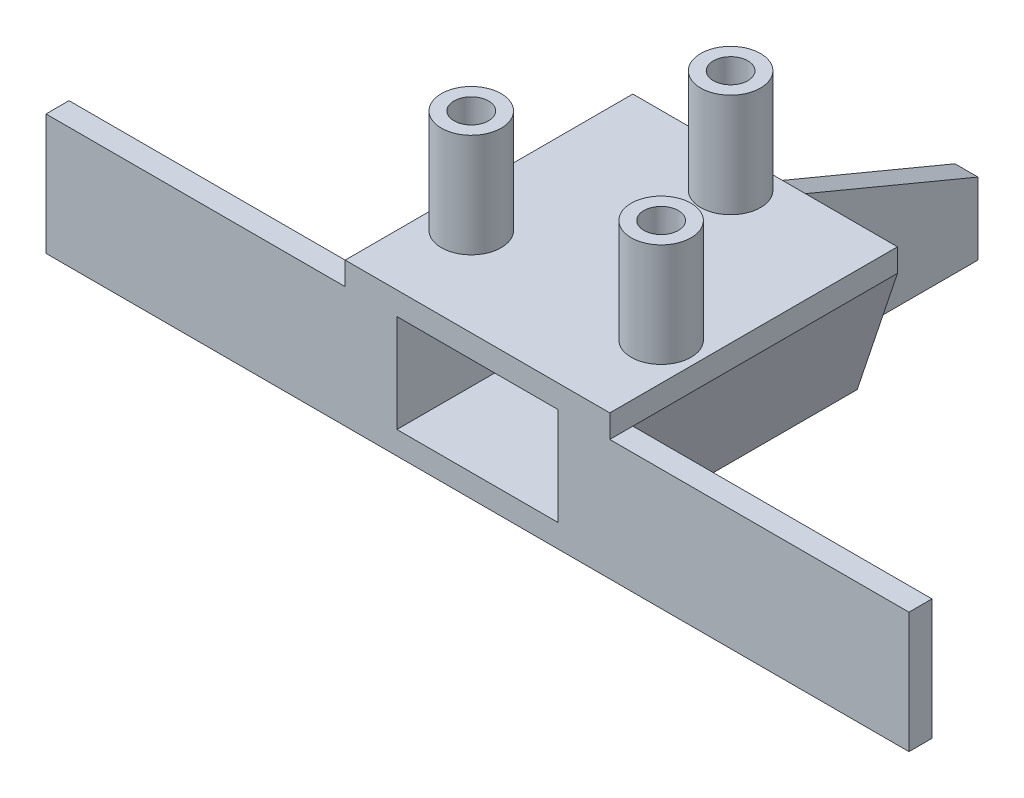
ISO-10303-21;
HEADER;
FILE_DESCRIPTION(('STEP AP214'),'2;1');
FILE_NAME('part.step','',(''),(''),'','','');
FILE_SCHEMA(('AUTOMOTIVE_DESIGN { 1 0 10303 214 1 1 1 1 }'));
ENDSEC;
DATA;
#1=APPLICATION_CONTEXT('core data for automotive mechanical design processes');
#2=APPLICATION_PROTOCOL_DEFINITION('international standard','automotive_design',2000,#1);
#3=PRODUCT_CONTEXT('',#1,'mechanical');
#4=PRODUCT('Part','Part','',(#3));
#5=PRODUCT_RELATED_PRODUCT_CATEGORY('part','',(#4));
#6=PRODUCT_DEFINITION_FORMATION('','',#4);
#7=PRODUCT_DEFINITION_CONTEXT('part definition',#1,'design');
#8=PRODUCT_DEFINITION('design','',#6,#7);
#9=PRODUCT_DEFINITION_SHAPE('','',#8);
#10=(LENGTH_UNIT() NAMED_UNIT(*) SI_UNIT(.MILLI.,.METRE.));
#11=(NAMED_UNIT(*) PLANE_ANGLE_UNIT() SI_UNIT($,.RADIAN.));
#12=(NAMED_UNIT(*) SI_UNIT($,.STERADIAN.) SOLID_ANGLE_UNIT());
#13=UNCERTAINTY_MEASURE_WITH_UNIT(LENGTH_MEASURE(1.E-05),#10,'distance_accuracy_value','');
#14=(GEOMETRIC_REPRESENTATION_CONTEXT(3) GLOBAL_UNCERTAINTY_ASSIGNED_CONTEXT((#13)) GLOBAL_UNIT_ASSIGNED_CONTEXT((#10,
#11,#12)) REPRESENTATION_CONTEXT('',''));
#15=CARTESIAN_POINT('',(0.,0.,0.));
#16=DIRECTION('',(0.,0.,1.));
#17=DIRECTION('',(1.,0.,0.));
#18=AXIS2_PLACEMENT_3D('',#15,#16,#17);
#19=CARTESIAN_POINT('',(0.,-12.5,0.));
#20=DIRECTION('',(0.,1.,0.));
#21=DIRECTION('',(0.,0.,1.));
#22=AXIS2_PLACEMENT_3D('',#19,#20,#21);
#23=PLANE('',#22);
#24=DIRECTION('',(0.,0.,-1.));
#25=VECTOR('',#24,1.);
#26=CARTESIAN_POINT('',(8.,-12.5,31.0679718105893));
#27=LINE('',#26,#25);
#28=CARTESIAN_POINT('',(8.,-12.5,20.));
#29=VERTEX_POINT('',#28);
#30=CARTESIAN_POINT('',(8.,-12.5,-3.));
#31=VERTEX_POINT('',#30);
#32=EDGE_CURVE('E724',#29,#31,#27,.T.);
#33=ORIENTED_EDGE('',*,*,#32,.F.);
#34=DIRECTION('',(-1.,0.,0.));
#35=VECTOR('',#34,1.);
#36=CARTESIAN_POINT('',(37.5,-12.5,20.));
#37=LINE('',#36,#35);
#38=CARTESIAN_POINT('',(37.5,-12.5,20.));
#39=VERTEX_POINT('',#38);
#40=EDGE_CURVE('E737',#39,#29,#37,.T.);
#41=ORIENTED_EDGE('',*,*,#40,.F.);
#42=DIRECTION('',(0.,0.,-1.));
#43=VECTOR('',#42,1.);
#44=CARTESIAN_POINT('',(37.5,-12.5,-3.));
#45=LINE('',#44,#43);
#46=CARTESIAN_POINT('',(37.5,-12.5,22.));
#47=VERTEX_POINT('',#46);
#48=EDGE_CURVE('E257',#47,#39,#45,.T.);
#49=ORIENTED_EDGE('',*,*,#48,.F.);
#50=DIRECTION('',(1.,0.,0.));
#51=VECTOR('',#50,1.);
#52=CARTESIAN_POINT('',(-11.5,-12.5,22.));
#53=LINE('',#52,#51);
#54=CARTESIAN_POINT('',(-37.5,-12.5,22.));
#55=VERTEX_POINT('',#54);
#56=EDGE_CURVE('E221',#55,#47,#53,.T.);
#57=ORIENTED_EDGE('',*,*,#56,.F.);
#58=DIRECTION('',(0.,0.,-1.));
#59=VECTOR('',#58,1.);
#60=CARTESIAN_POINT('',(-37.5,-12.5,-3.));
#61=LINE('',#60,#59);
#62=CARTESIAN_POINT('',(-37.5,-12.5,20.));
#63=VERTEX_POINT('',#62);
#64=EDGE_CURVE('E271',#55,#63,#61,.T.);
#65=ORIENTED_EDGE('',*,*,#64,.T.);
#66=DIRECTION('',(1.,0.,0.));
#67=VECTOR('',#66,1.);
#68=CARTESIAN_POINT('',(-37.5,-12.5,20.));
#69=LINE('',#68,#67);
#70=CARTESIAN_POINT('',(-8.,-12.5,20.));
#71=VERTEX_POINT('',#70);
#72=EDGE_CURVE('E285',#63,#71,#69,.T.);
#73=ORIENTED_EDGE('',*,*,#72,.T.);
#74=DIRECTION('',(0.,0.,-1.));
#75=VECTOR('',#74,1.);
#76=CARTESIAN_POINT('',(-8.,-12.5,31.0679718105893));
#77=LINE('',#76,#75);
#78=CARTESIAN_POINT('',(-8.,-12.5,-3.));
#79=VERTEX_POINT('',#78);
#80=EDGE_CURVE('E717',#71,#79,#77,.T.);
#81=ORIENTED_EDGE('',*,*,#80,.T.);
#82=DIRECTION('',(-1.,0.,0.));
#83=VECTOR('',#82,1.);
#84=CARTESIAN_POINT('',(-11.5,-12.5,-3.));
#85=LINE('',#84,#83);
#86=CARTESIAN_POINT('',(1.5,-12.5,-3.));
#87=VERTEX_POINT('',#86);
#88=EDGE_CURVE('E216',#87,#79,#85,.T.);
#89=ORIENTED_EDGE('',*,*,#88,.F.);
#90=DIRECTION('',(0.,0.,1.));
#91=VECTOR('',#90,1.);
#92=CARTESIAN_POINT('',(1.5,-12.5,-18.));
#93=LINE('',#92,#91);
#94=CARTESIAN_POINT('',(1.5,-12.5,-18.));
#95=VERTEX_POINT('',#94);
#96=EDGE_CURVE('E198',#95,#87,#93,.T.);
#97=ORIENTED_EDGE('',*,*,#96,.F.);
#98=DIRECTION('',(-1.,0.,0.));
#99=VECTOR('',#98,1.);
#100=CARTESIAN_POINT('',(1.5,-12.5,-18.));
#101=LINE('',#100,#99);
#102=CARTESIAN_POINT('',(3.5,-12.5,-18.));
#103=VERTEX_POINT('',#102);
#104=EDGE_CURVE('E185',#103,#95,#101,.T.);
#105=ORIENTED_EDGE('',*,*,#104,.F.);
#106=DIRECTION('',(0.,0.,1.));
#107=VECTOR('',#106,1.);
#108=CARTESIAN_POINT('',(3.5,-12.5,-18.));
#109=LINE('',#108,#107);
#110=CARTESIAN_POINT('',(3.5,-12.5,-3.));
#111=VERTEX_POINT('',#110);
#112=EDGE_CURVE('E209',#103,#111,#109,.T.);
#113=ORIENTED_EDGE('',*,*,#112,.T.);
#114=EDGE_CURVE('E212',#31,#111,#85,.T.);
#115=ORIENTED_EDGE('',*,*,#114,.F.);
#116=EDGE_LOOP('',(#33,#41,#49,#57,#65,#73,#81,#89,#97,#105,#113,#115));
#117=FACE_BOUND('',#116,.T.);
#118=ADVANCED_FACE('F35',(#117),#23,.F.);
#119=CARTESIAN_POINT('',(-11.5,-12.5,-3.));
#120=DIRECTION('',(0.,0.,-1.));
#121=DIRECTION('',(-1.,0.,0.));
#122=AXIS2_PLACEMENT_3D('',#119,#120,#121);
#123=PLANE('',#122);
#124=DIRECTION('',(0.,1.,0.));
#125=VECTOR('',#124,1.);
#126=CARTESIAN_POINT('',(11.5,-12.5,-3.));
#127=LINE('',#126,#125);
#128=CARTESIAN_POINT('',(11.5,-2.,-3.));
#129=VERTEX_POINT('',#128);
#130=CARTESIAN_POINT('',(11.5,0.,-3.));
#131=VERTEX_POINT('',#130);
#132=EDGE_CURVE('E758',#129,#131,#127,.T.);
#133=ORIENTED_EDGE('',*,*,#132,.F.);
#134=DIRECTION('',(-0.316227766016838,-0.948683298050514,0.));
#135=VECTOR('',#134,1.);
#136=CARTESIAN_POINT('',(8.,-12.5,-3.));
#137=LINE('',#136,#135);
#138=EDGE_CURVE('E729',#129,#31,#137,.T.);
#139=ORIENTED_EDGE('',*,*,#138,.T.);
#140=ORIENTED_EDGE('',*,*,#114,.T.);
#141=DIRECTION('',(0.,-1.,0.));
#142=VECTOR('',#141,1.);
#143=CARTESIAN_POINT('',(3.5,-12.5,-3.));
#144=LINE('',#143,#142);
#145=CARTESIAN_POINT('',(3.5,0.,-3.));
#146=VERTEX_POINT('',#145);
#147=EDGE_CURVE('E188',#146,#111,#144,.T.);
#148=ORIENTED_EDGE('',*,*,#147,.F.);
#149=DIRECTION('',(-1.,0.,0.));
#150=VECTOR('',#149,1.);
#151=CARTESIAN_POINT('',(-11.5,0.,-3.));
#152=LINE('',#151,#150);
#153=EDGE_CURVE('E749',#131,#146,#152,.T.);
#154=ORIENTED_EDGE('',*,*,#153,.F.);
#155=EDGE_LOOP('',(#133,#139,#140,#148,#154));
#156=FACE_BOUND('',#155,.T.);
#157=ADVANCED_FACE('F367',(#156),#123,.T.);
#158=CARTESIAN_POINT('',(11.5,-12.5,-3.));
#159=DIRECTION('',(1.,0.,0.));
#160=DIRECTION('',(0.,0.,-1.));
#161=AXIS2_PLACEMENT_3D('',#158,#159,#160);
#162=PLANE('',#161);
#163=DIRECTION('',(0.,0.,1.));
#164=VECTOR('',#163,1.);
#165=CARTESIAN_POINT('',(11.5,-2.00000000000001,-3.00000000000001));
#166=LINE('',#165,#164);
#167=CARTESIAN_POINT('',(11.5,-2.,20.));
#168=VERTEX_POINT('',#167);
#169=CARTESIAN_POINT('',(11.5,-2.,22.));
#170=VERTEX_POINT('',#169);
#171=EDGE_CURVE('E232',#168,#170,#166,.T.);
#172=ORIENTED_EDGE('',*,*,#171,.F.);
#173=DIRECTION('',(0.,0.,-1.));
#174=VECTOR('',#173,1.);
#175=CARTESIAN_POINT('',(11.5,-2.,31.0679718105893));
#176=LINE('',#175,#174);
#177=EDGE_CURVE('E726',#168,#129,#176,.T.);
#178=ORIENTED_EDGE('',*,*,#177,.T.);
#179=ORIENTED_EDGE('',*,*,#132,.T.);
#180=DIRECTION('',(0.,0.,-1.));
#181=VECTOR('',#180,1.);
#182=CARTESIAN_POINT('',(11.5,0.,-3.));
#183=LINE('',#182,#181);
#184=CARTESIAN_POINT('',(11.5,0.,22.));
#185=VERTEX_POINT('',#184);
#186=EDGE_CURVE('E754',#185,#131,#183,.T.);
#187=ORIENTED_EDGE('',*,*,#186,.F.);
#188=DIRECTION('',(0.,1.,0.));
#189=VECTOR('',#188,1.);
#190=CARTESIAN_POINT('',(11.5,-12.5,22.));
#191=LINE('',#190,#189);
#192=EDGE_CURVE('E249',#170,#185,#191,.T.);
#193=ORIENTED_EDGE('',*,*,#192,.F.);
#194=EDGE_LOOP('',(#172,#178,#179,#187,#193));
#195=FACE_BOUND('',#194,.T.);
#196=ADVANCED_FACE('F372',(#195),#162,.T.);
#197=ORIENTED_EDGE('',*,*,#88,.T.);
#198=DIRECTION('',(-0.316227766016837,0.948683298050514,0.));
#199=VECTOR('',#198,1.);
#200=CARTESIAN_POINT('',(-11.5,-2.,-3.));
#201=LINE('',#200,#199);
#202=CARTESIAN_POINT('',(-11.5,-2.,-3.));
#203=VERTEX_POINT('',#202);
#204=EDGE_CURVE('E715',#79,#203,#201,.T.);
#205=ORIENTED_EDGE('',*,*,#204,.T.);
#206=DIRECTION('',(0.,1.,0.));
#207=VECTOR('',#206,1.);
#208=CARTESIAN_POINT('',(-11.5,-12.5,-3.));
#209=LINE('',#208,#207);
#210=CARTESIAN_POINT('',(-11.5,0.,-3.));
#211=VERTEX_POINT('',#210);
#212=EDGE_CURVE('E755',#203,#211,#209,.T.);
#213=ORIENTED_EDGE('',*,*,#212,.T.);
#214=CARTESIAN_POINT('',(1.5,0.,-3.));
#215=VERTEX_POINT('',#214);
#216=EDGE_CURVE('E228',#215,#211,#152,.T.);
#217=ORIENTED_EDGE('',*,*,#216,.F.);
#218=DIRECTION('',(0.,1.,0.));
#219=VECTOR('',#218,1.);
#220=CARTESIAN_POINT('',(1.5,-12.5,-3.));
#221=LINE('',#220,#219);
#222=EDGE_CURVE('E60',#87,#215,#221,.T.);
#223=ORIENTED_EDGE('',*,*,#222,.F.);
#224=EDGE_LOOP('',(#197,#205,#213,#217,#223));
#225=FACE_BOUND('',#224,.T.);
#226=ADVANCED_FACE('F375',(#225),#123,.T.);
#227=CARTESIAN_POINT('',(-11.5,-12.5,-3.));
#228=DIRECTION('',(-1.,0.,0.));
#229=DIRECTION('',(0.,0.,1.));
#230=AXIS2_PLACEMENT_3D('',#227,#228,#229);
#231=PLANE('',#230);
#232=ORIENTED_EDGE('',*,*,#212,.F.);
#233=DIRECTION('',(0.,0.,-1.));
#234=VECTOR('',#233,1.);
#235=CARTESIAN_POINT('',(-11.5,-2.,31.0679718105893));
#236=LINE('',#235,#234);
#237=CARTESIAN_POINT('',(-11.5,-2.,20.));
#238=VERTEX_POINT('',#237);
#239=EDGE_CURVE('E719',#238,#203,#236,.T.);
#240=ORIENTED_EDGE('',*,*,#239,.F.);
#241=DIRECTION('',(0.,0.,1.));
#242=VECTOR('',#241,1.);
#243=CARTESIAN_POINT('',(-11.5,-2.00000000000001,-3.00000000000001));
#244=LINE('',#243,#242);
#245=CARTESIAN_POINT('',(-11.5,-2.,22.));
#246=VERTEX_POINT('',#245);
#247=EDGE_CURVE('E261',#238,#246,#244,.T.);
#248=ORIENTED_EDGE('',*,*,#247,.T.);
#249=DIRECTION('',(0.,1.,0.));
#250=VECTOR('',#249,1.);
#251=CARTESIAN_POINT('',(-11.5,-12.5,22.));
#252=LINE('',#251,#250);
#253=CARTESIAN_POINT('',(-11.5,0.,22.));
#254=VERTEX_POINT('',#253);
#255=EDGE_CURVE('E215',#246,#254,#252,.T.);
#256=ORIENTED_EDGE('',*,*,#255,.T.);
#257=DIRECTION('',(0.,0.,1.));
#258=VECTOR('',#257,1.);
#259=CARTESIAN_POINT('',(-11.5,0.,-3.));
#260=LINE('',#259,#258);
#261=EDGE_CURVE('E223',#211,#254,#260,.T.);
#262=ORIENTED_EDGE('',*,*,#261,.F.);
#263=EDGE_LOOP('',(#232,#240,#248,#256,#262));
#264=FACE_BOUND('',#263,.T.);
#265=ADVANCED_FACE('F342',(#264),#231,.T.);
#266=CARTESIAN_POINT('',(0.,0.,0.));
#267=DIRECTION('',(0.,1.,0.));
#268=DIRECTION('',(0.,0.,1.));
#269=AXIS2_PLACEMENT_3D('',#266,#267,#268);
#270=PLANE('',#269);
#271=DIRECTION('',(-1.,0.,0.));
#272=VECTOR('',#271,1.);
#273=CARTESIAN_POINT('',(19.75,0.,-3.));
#274=LINE('',#273,#272);
#275=EDGE_CURVE('E175',#146,#215,#274,.T.);
#276=ORIENTED_EDGE('',*,*,#275,.T.);
#277=ORIENTED_EDGE('',*,*,#216,.T.);
#278=ORIENTED_EDGE('',*,*,#261,.T.);
#279=DIRECTION('',(1.,0.,0.));
#280=VECTOR('',#279,1.);
#281=CARTESIAN_POINT('',(-11.5,0.,22.));
#282=LINE('',#281,#280);
#283=EDGE_CURVE('E770',#254,#185,#282,.T.);
#284=ORIENTED_EDGE('',*,*,#283,.T.);
#285=ORIENTED_EDGE('',*,*,#186,.T.);
#286=ORIENTED_EDGE('',*,*,#153,.T.);
#287=EDGE_LOOP('',(#276,#277,#278,#284,#285,#286));
#288=FACE_BOUND('',#287,.T.);
#289=CARTESIAN_POINT('',(-8.25,0.,14.2894191624432));
#290=DIRECTION('',(0.,1.,0.));
#291=DIRECTION('',(0.,0.,1.));
#292=AXIS2_PLACEMENT_3D('',#289,#290,#291);
#293=CIRCLE('',#292,2.6);
#294=CARTESIAN_POINT('',(-8.25,0.,16.8894191624432));
#295=VERTEX_POINT('',#294);
#296=EDGE_CURVE('E413',#295,#295,#293,.T.);
#297=ORIENTED_EDGE('',*,*,#296,.F.);
#298=EDGE_LOOP('',(#297));
#299=FACE_BOUND('',#298,.T.);
#300=CARTESIAN_POINT('',(0.,0.,0.));
#301=DIRECTION('',(0.,1.,0.));
#302=DIRECTION('',(0.,0.,1.));
#303=AXIS2_PLACEMENT_3D('',#300,#301,#302);
#304=CIRCLE('',#303,2.6);
#305=CARTESIAN_POINT('',(0.,0.,2.6));
#306=VERTEX_POINT('',#305);
#307=EDGE_CURVE('E330',#306,#306,#304,.T.);
#308=ORIENTED_EDGE('',*,*,#307,.F.);
#309=EDGE_LOOP('',(#308));
#310=FACE_BOUND('',#309,.T.);
#311=CARTESIAN_POINT('',(8.25,0.,14.2894191624432));
#312=DIRECTION('',(0.,1.,0.));
#313=DIRECTION('',(0.,0.,1.));
#314=AXIS2_PLACEMENT_3D('',#311,#312,#313);
#315=CIRCLE('',#314,2.6);
#316=CARTESIAN_POINT('',(8.25,0.,16.8894191624432));
#317=VERTEX_POINT('',#316);
#318=EDGE_CURVE('E321',#317,#317,#315,.T.);
#319=ORIENTED_EDGE('',*,*,#318,.F.);
#320=EDGE_LOOP('',(#319));
#321=FACE_BOUND('',#320,.T.);
#322=ADVANCED_FACE('F338',(#288,#299,#310,#321),#270,.T.);
#323=CARTESIAN_POINT('',(-8.25,9.,14.2894191624432));
#324=DIRECTION('',(0.,1.,0.));
#325=DIRECTION('',(0.,0.,1.));
#326=AXIS2_PLACEMENT_3D('',#323,#324,#325);
#327=PLANE('',#326);
#328=CARTESIAN_POINT('',(-8.25,9.,14.2894191624432));
#329=DIRECTION('',(0.,1.,0.));
#330=DIRECTION('',(0.,0.,1.));
#331=AXIS2_PLACEMENT_3D('',#328,#329,#330);
#332=CIRCLE('',#331,2.6);
#333=CARTESIAN_POINT('',(-8.25,9.,16.8894191624432));
#334=VERTEX_POINT('',#333);
#335=EDGE_CURVE('E405',#334,#334,#332,.T.);
#336=ORIENTED_EDGE('',*,*,#335,.T.);
#337=EDGE_LOOP('',(#336));
#338=FACE_BOUND('',#337,.T.);
#339=CARTESIAN_POINT('',(-8.25,9.,14.2894191624432));
#340=DIRECTION('',(0.,1.,0.));
#341=DIRECTION('',(0.,0.,1.));
#342=AXIS2_PLACEMENT_3D('',#339,#340,#341);
#343=CIRCLE('',#342,1.5);
#344=CARTESIAN_POINT('',(-8.25,9.,15.7894191624432));
#345=VERTEX_POINT('',#344);
#346=EDGE_CURVE('E408',#345,#345,#343,.T.);
#347=ORIENTED_EDGE('',*,*,#346,.F.);
#348=EDGE_LOOP('',(#347));
#349=FACE_BOUND('',#348,.T.);
#350=ADVANCED_FACE('F341',(#338,#349),#327,.T.);
#351=CARTESIAN_POINT('',(-8.25,9.,14.2894191624432));
#352=DIRECTION('',(0.,-1.,0.));
#353=DIRECTION('',(0.,0.,-1.));
#354=AXIS2_PLACEMENT_3D('',#351,#352,#353);
#355=CYLINDRICAL_SURFACE('',#354,2.6);
#356=ORIENTED_EDGE('',*,*,#335,.F.);
#357=EDGE_LOOP('',(#356));
#358=FACE_BOUND('',#357,.T.);
#359=ORIENTED_EDGE('',*,*,#296,.T.);
#360=EDGE_LOOP('',(#359));
#361=FACE_BOUND('',#360,.T.);
#362=ADVANCED_FACE('F37',(#358,#361),#355,.T.);
#363=CARTESIAN_POINT('',(-8.25,9.,14.2894191624432));
#364=DIRECTION('',(0.,-1.,0.));
#365=DIRECTION('',(0.,0.,-1.));
#366=AXIS2_PLACEMENT_3D('',#363,#364,#365);
#367=CYLINDRICAL_SURFACE('',#366,1.5);
#368=ORIENTED_EDGE('',*,*,#346,.T.);
#369=EDGE_LOOP('',(#368));
#370=FACE_BOUND('',#369,.T.);
#371=CARTESIAN_POINT('',(-8.25,0.,14.2894191624432));
#372=DIRECTION('',(0.,1.,0.));
#373=DIRECTION('',(0.,0.,1.));
#374=AXIS2_PLACEMENT_3D('',#371,#372,#373);
#375=CIRCLE('',#374,1.5);
#376=CARTESIAN_POINT('',(-8.25,0.,15.7894191624432));
#377=VERTEX_POINT('',#376);
#378=EDGE_CURVE('E409',#377,#377,#375,.T.);
#379=ORIENTED_EDGE('',*,*,#378,.F.);
#380=EDGE_LOOP('',(#379));
#381=FACE_BOUND('',#380,.T.);
#382=ADVANCED_FACE('F381',(#370,#381),#367,.F.);
#383=ORIENTED_EDGE('',*,*,#378,.T.);
#384=EDGE_LOOP('',(#383));
#385=FACE_BOUND('',#384,.T.);
#386=ADVANCED_FACE('F346',(#385),#270,.T.);
#387=CARTESIAN_POINT('',(-11.5,-12.5,22.));
#388=DIRECTION('',(0.,0.,1.));
#389=DIRECTION('',(1.,0.,0.));
#390=AXIS2_PLACEMENT_3D('',#387,#388,#389);
#391=PLANE('',#390);
#392=DIRECTION('',(0.,1.,0.));
#393=VECTOR('',#392,1.);
#394=CARTESIAN_POINT('',(-7.,-10.5,22.));
#395=LINE('',#394,#393);
#396=CARTESIAN_POINT('',(-7.,-10.5,22.));
#397=VERTEX_POINT('',#396);
#398=CARTESIAN_POINT('',(-7.,-2.,22.));
#399=VERTEX_POINT('',#398);
#400=EDGE_CURVE('E309',#397,#399,#395,.T.);
#401=ORIENTED_EDGE('',*,*,#400,.T.);
#402=DIRECTION('',(1.,0.,0.));
#403=VECTOR('',#402,1.);
#404=CARTESIAN_POINT('',(-7.,-2.,22.));
#405=LINE('',#404,#403);
#406=CARTESIAN_POINT('',(7.,-2.,22.));
#407=VERTEX_POINT('',#406);
#408=EDGE_CURVE('E813',#399,#407,#405,.T.);
#409=ORIENTED_EDGE('',*,*,#408,.T.);
#410=DIRECTION('',(0.,-1.,0.));
#411=VECTOR('',#410,1.);
#412=CARTESIAN_POINT('',(7.,-10.5,22.));
#413=LINE('',#412,#411);
#414=CARTESIAN_POINT('',(7.,-10.5,22.));
#415=VERTEX_POINT('',#414);
#416=EDGE_CURVE('E815',#407,#415,#413,.T.);
#417=ORIENTED_EDGE('',*,*,#416,.T.);
#418=DIRECTION('',(-1.,0.,0.));
#419=VECTOR('',#418,1.);
#420=CARTESIAN_POINT('',(-7.,-10.5,22.));
#421=LINE('',#420,#419);
#422=EDGE_CURVE('E301',#415,#397,#421,.T.);
#423=ORIENTED_EDGE('',*,*,#422,.T.);
#424=EDGE_LOOP('',(#401,#409,#417,#423));
#425=FACE_BOUND('',#424,.T.);
#426=ORIENTED_EDGE('',*,*,#283,.F.);
#427=ORIENTED_EDGE('',*,*,#255,.F.);
#428=DIRECTION('',(1.,0.,0.));
#429=VECTOR('',#428,1.);
#430=CARTESIAN_POINT('',(-37.5,-2.,22.));
#431=LINE('',#430,#429);
#432=CARTESIAN_POINT('',(-37.5,-2.,22.));
#433=VERTEX_POINT('',#432);
#434=EDGE_CURVE('E283',#433,#246,#431,.T.);
#435=ORIENTED_EDGE('',*,*,#434,.F.);
#436=DIRECTION('',(0.,-1.,0.));
#437=VECTOR('',#436,1.);
#438=CARTESIAN_POINT('',(-37.5,-12.5,22.));
#439=LINE('',#438,#437);
#440=EDGE_CURVE('E268',#433,#55,#439,.T.);
#441=ORIENTED_EDGE('',*,*,#440,.T.);
#442=ORIENTED_EDGE('',*,*,#56,.T.);
#443=DIRECTION('',(0.,-1.,0.));
#444=VECTOR('',#443,1.);
#445=CARTESIAN_POINT('',(37.5,-12.5,22.));
#446=LINE('',#445,#444);
#447=CARTESIAN_POINT('',(37.5,-2.,22.));
#448=VERTEX_POINT('',#447);
#449=EDGE_CURVE('E742',#448,#47,#446,.T.);
#450=ORIENTED_EDGE('',*,*,#449,.F.);
#451=DIRECTION('',(-1.,0.,0.));
#452=VECTOR('',#451,1.);
#453=CARTESIAN_POINT('',(37.5,-2.,22.));
#454=LINE('',#453,#452);
#455=EDGE_CURVE('E252',#448,#170,#454,.T.);
#456=ORIENTED_EDGE('',*,*,#455,.T.);
#457=ORIENTED_EDGE('',*,*,#192,.T.);
#458=EDGE_LOOP('',(#426,#427,#435,#441,#442,#450,#456,#457));
#459=FACE_BOUND('',#458,.T.);
#460=ADVANCED_FACE('F380',(#425,#459),#391,.T.);
#461=CARTESIAN_POINT('',(0.,9.,0.));
#462=DIRECTION('',(0.,1.,0.));
#463=DIRECTION('',(0.,0.,1.));
#464=AXIS2_PLACEMENT_3D('',#461,#462,#463);
#465=PLANE('',#464);
#466=CARTESIAN_POINT('',(0.,9.,0.));
#467=DIRECTION('',(0.,1.,0.));
#468=DIRECTION('',(0.,0.,1.));
#469=AXIS2_PLACEMENT_3D('',#466,#467,#468);
#470=CIRCLE('',#469,2.6);
#471=CARTESIAN_POINT('',(0.,9.,2.6));
#472=VERTEX_POINT('',#471);
#473=EDGE_CURVE('E331',#472,#472,#470,.T.);
#474=ORIENTED_EDGE('',*,*,#473,.T.);
#475=EDGE_LOOP('',(#474));
#476=FACE_BOUND('',#475,.T.);
#477=CARTESIAN_POINT('',(0.,9.,0.));
#478=DIRECTION('',(0.,1.,0.));
#479=DIRECTION('',(0.,0.,1.));
#480=AXIS2_PLACEMENT_3D('',#477,#478,#479);
#481=CIRCLE('',#480,1.5);
#482=CARTESIAN_POINT('',(0.,9.,1.5));
#483=VERTEX_POINT('',#482);
#484=EDGE_CURVE('E325',#483,#483,#481,.T.);
#485=ORIENTED_EDGE('',*,*,#484,.F.);
#486=EDGE_LOOP('',(#485));
#487=FACE_BOUND('',#486,.T.);
#488=ADVANCED_FACE('F389',(#476,#487),#465,.T.);
#489=CARTESIAN_POINT('',(0.,9.,0.));
#490=DIRECTION('',(0.,-1.,0.));
#491=DIRECTION('',(0.,0.,-1.));
#492=AXIS2_PLACEMENT_3D('',#489,#490,#491);
#493=CYLINDRICAL_SURFACE('',#492,2.6);
#494=ORIENTED_EDGE('',*,*,#473,.F.);
#495=EDGE_LOOP('',(#494));
#496=FACE_BOUND('',#495,.T.);
#497=ORIENTED_EDGE('',*,*,#307,.T.);
#498=EDGE_LOOP('',(#497));
#499=FACE_BOUND('',#498,.T.);
#500=ADVANCED_FACE('F336',(#496,#499),#493,.T.);
#501=CARTESIAN_POINT('',(0.,9.,0.));
#502=DIRECTION('',(0.,-1.,0.));
#503=DIRECTION('',(0.,0.,-1.));
#504=AXIS2_PLACEMENT_3D('',#501,#502,#503);
#505=CYLINDRICAL_SURFACE('',#504,1.5);
#506=ORIENTED_EDGE('',*,*,#484,.T.);
#507=EDGE_LOOP('',(#506));
#508=FACE_BOUND('',#507,.T.);
#509=CARTESIAN_POINT('',(0.,0.,0.));
#510=DIRECTION('',(0.,1.,0.));
#511=DIRECTION('',(0.,0.,1.));
#512=AXIS2_PLACEMENT_3D('',#509,#510,#511);
#513=CIRCLE('',#512,1.5);
#514=CARTESIAN_POINT('',(0.,0.,1.5));
#515=VERTEX_POINT('',#514);
#516=EDGE_CURVE('E44',#515,#515,#513,.F.);
#517=ORIENTED_EDGE('',*,*,#516,.T.);
#518=EDGE_LOOP('',(#517));
#519=FACE_BOUND('',#518,.T.);
#520=ADVANCED_FACE('F420',(#508,#519),#505,.F.);
#521=ORIENTED_EDGE('',*,*,#516,.F.);
#522=EDGE_LOOP('',(#521));
#523=FACE_BOUND('',#522,.T.);
#524=ADVANCED_FACE('F361',(#523),#270,.T.);
#525=CARTESIAN_POINT('',(8.25,9.,14.2894191624432));
#526=DIRECTION('',(0.,1.,0.));
#527=DIRECTION('',(0.,0.,1.));
#528=AXIS2_PLACEMENT_3D('',#525,#526,#527);
#529=PLANE('',#528);
#530=CARTESIAN_POINT('',(8.25,9.,14.2894191624432));
#531=DIRECTION('',(0.,1.,0.));
#532=DIRECTION('',(0.,0.,1.));
#533=AXIS2_PLACEMENT_3D('',#530,#531,#532);
#534=CIRCLE('',#533,2.6);
#535=CARTESIAN_POINT('',(8.25,9.,16.8894191624432));
#536=VERTEX_POINT('',#535);
#537=EDGE_CURVE('E322',#536,#536,#534,.T.);
#538=ORIENTED_EDGE('',*,*,#537,.T.);
#539=EDGE_LOOP('',(#538));
#540=FACE_BOUND('',#539,.T.);
#541=CARTESIAN_POINT('',(8.25,9.,14.2894191624432));
#542=DIRECTION('',(0.,1.,0.));
#543=DIRECTION('',(0.,0.,1.));
#544=AXIS2_PLACEMENT_3D('',#541,#542,#543);
#545=CIRCLE('',#544,1.5);
#546=CARTESIAN_POINT('',(8.25,9.,15.7894191624432));
#547=VERTEX_POINT('',#546);
#548=EDGE_CURVE('E312',#547,#547,#545,.T.);
#549=ORIENTED_EDGE('',*,*,#548,.F.);
#550=EDGE_LOOP('',(#549));
#551=FACE_BOUND('',#550,.T.);
#552=ADVANCED_FACE('F352',(#540,#551),#529,.T.);
#553=CARTESIAN_POINT('',(8.25,9.,14.2894191624432));
#554=DIRECTION('',(0.,-1.,0.));
#555=DIRECTION('',(0.,0.,-1.));
#556=AXIS2_PLACEMENT_3D('',#553,#554,#555);
#557=CYLINDRICAL_SURFACE('',#556,2.6);
#558=ORIENTED_EDGE('',*,*,#537,.F.);
#559=EDGE_LOOP('',(#558));
#560=FACE_BOUND('',#559,.T.);
#561=ORIENTED_EDGE('',*,*,#318,.T.);
#562=EDGE_LOOP('',(#561));
#563=FACE_BOUND('',#562,.T.);
#564=ADVANCED_FACE('F349',(#560,#563),#557,.T.);
#565=CARTESIAN_POINT('',(8.25,9.,14.2894191624432));
#566=DIRECTION('',(0.,-1.,0.));
#567=DIRECTION('',(0.,0.,-1.));
#568=AXIS2_PLACEMENT_3D('',#565,#566,#567);
#569=CYLINDRICAL_SURFACE('',#568,1.5);
#570=ORIENTED_EDGE('',*,*,#548,.T.);
#571=EDGE_LOOP('',(#570));
#572=FACE_BOUND('',#571,.T.);
#573=CARTESIAN_POINT('',(8.25,0.,14.2894191624432));
#574=DIRECTION('',(0.,1.,0.));
#575=DIRECTION('',(0.,0.,1.));
#576=AXIS2_PLACEMENT_3D('',#573,#574,#575);
#577=CIRCLE('',#576,1.5);
#578=CARTESIAN_POINT('',(8.25,0.,15.7894191624432));
#579=VERTEX_POINT('',#578);
#580=EDGE_CURVE('E11',#579,#579,#577,.F.);
#581=ORIENTED_EDGE('',*,*,#580,.T.);
#582=EDGE_LOOP('',(#581));
#583=FACE_BOUND('',#582,.T.);
#584=ADVANCED_FACE('F351',(#572,#583),#569,.F.);
#585=ORIENTED_EDGE('',*,*,#580,.F.);
#586=EDGE_LOOP('',(#585));
#587=FACE_BOUND('',#586,.T.);
#588=ADVANCED_FACE('F345',(#587),#270,.T.);
#589=CARTESIAN_POINT('',(-7.,-10.5,22.));
#590=DIRECTION('',(-1.,0.,0.));
#591=DIRECTION('',(0.,-1.,0.));
#592=AXIS2_PLACEMENT_3D('',#589,#590,#591);
#593=PLANE('',#592);
#594=DIRECTION('',(0.,1.,0.));
#595=VECTOR('',#594,1.);
#596=CARTESIAN_POINT('',(-7.,-10.5,-1.));
#597=LINE('',#596,#595);
#598=CARTESIAN_POINT('',(-7.,-10.5,-1.));
#599=VERTEX_POINT('',#598);
#600=CARTESIAN_POINT('',(-7.,-2.,-1.));
#601=VERTEX_POINT('',#600);
#602=EDGE_CURVE('E288',#599,#601,#597,.T.);
#603=ORIENTED_EDGE('',*,*,#602,.T.);
#604=DIRECTION('',(0.,0.,-1.));
#605=VECTOR('',#604,1.);
#606=CARTESIAN_POINT('',(-7.,-2.,22.));
#607=LINE('',#606,#605);
#608=EDGE_CURVE('E317',#399,#601,#607,.T.);
#609=ORIENTED_EDGE('',*,*,#608,.F.);
#610=ORIENTED_EDGE('',*,*,#400,.F.);
#611=DIRECTION('',(0.,0.,-1.));
#612=VECTOR('',#611,1.);
#613=CARTESIAN_POINT('',(-7.,-10.5,22.));
#614=LINE('',#613,#612);
#615=EDGE_CURVE('E310',#397,#599,#614,.T.);
#616=ORIENTED_EDGE('',*,*,#615,.T.);
#617=EDGE_LOOP('',(#603,#609,#610,#616));
#618=FACE_BOUND('',#617,.T.);
#619=ADVANCED_FACE('F428',(#618),#593,.F.);
#620=CARTESIAN_POINT('',(-7.,-10.5,22.));
#621=DIRECTION('',(0.,-1.,0.));
#622=DIRECTION('',(1.,0.,0.));
#623=AXIS2_PLACEMENT_3D('',#620,#621,#622);
#624=PLANE('',#623);
#625=DIRECTION('',(-1.,0.,0.));
#626=VECTOR('',#625,1.);
#627=CARTESIAN_POINT('',(-7.,-10.5,-1.));
#628=LINE('',#627,#626);
#629=CARTESIAN_POINT('',(7.,-10.5,-1.));
#630=VERTEX_POINT('',#629);
#631=EDGE_CURVE('E306',#630,#599,#628,.T.);
#632=ORIENTED_EDGE('',*,*,#631,.T.);
#633=ORIENTED_EDGE('',*,*,#615,.F.);
#634=ORIENTED_EDGE('',*,*,#422,.F.);
#635=DIRECTION('',(0.,0.,-1.));
#636=VECTOR('',#635,1.);
#637=CARTESIAN_POINT('',(7.,-10.5,22.));
#638=LINE('',#637,#636);
#639=EDGE_CURVE('E313',#415,#630,#638,.T.);
#640=ORIENTED_EDGE('',*,*,#639,.T.);
#641=EDGE_LOOP('',(#632,#633,#634,#640));
#642=FACE_BOUND('',#641,.T.);
#643=ADVANCED_FACE('F433',(#642),#624,.F.);
#644=CARTESIAN_POINT('',(7.,-10.5,22.));
#645=DIRECTION('',(1.,0.,0.));
#646=DIRECTION('',(0.,0.,-1.));
#647=AXIS2_PLACEMENT_3D('',#644,#645,#646);
#648=PLANE('',#647);
#649=DIRECTION('',(0.,-1.,0.));
#650=VECTOR('',#649,1.);
#651=CARTESIAN_POINT('',(7.,-10.5,-1.));
#652=LINE('',#651,#650);
#653=CARTESIAN_POINT('',(7.,-2.,-1.));
#654=VERTEX_POINT('',#653);
#655=EDGE_CURVE('E298',#654,#630,#652,.T.);
#656=ORIENTED_EDGE('',*,*,#655,.T.);
#657=ORIENTED_EDGE('',*,*,#639,.F.);
#658=ORIENTED_EDGE('',*,*,#416,.F.);
#659=DIRECTION('',(0.,0.,-1.));
#660=VECTOR('',#659,1.);
#661=CARTESIAN_POINT('',(7.,-2.,22.));
#662=LINE('',#661,#660);
#663=EDGE_CURVE('E315',#407,#654,#662,.T.);
#664=ORIENTED_EDGE('',*,*,#663,.T.);
#665=EDGE_LOOP('',(#656,#657,#658,#664));
#666=FACE_BOUND('',#665,.T.);
#667=ADVANCED_FACE('F440',(#666),#648,.F.);
#668=CARTESIAN_POINT('',(-7.,-2.,22.));
#669=DIRECTION('',(0.,1.,0.));
#670=DIRECTION('',(-1.,0.,0.));
#671=AXIS2_PLACEMENT_3D('',#668,#669,#670);
#672=PLANE('',#671);
#673=DIRECTION('',(1.,0.,0.));
#674=VECTOR('',#673,1.);
#675=CARTESIAN_POINT('',(-7.,-2.,-1.));
#676=LINE('',#675,#674);
#677=EDGE_CURVE('E293',#601,#654,#676,.T.);
#678=ORIENTED_EDGE('',*,*,#677,.T.);
#679=ORIENTED_EDGE('',*,*,#663,.F.);
#680=ORIENTED_EDGE('',*,*,#408,.F.);
#681=ORIENTED_EDGE('',*,*,#608,.T.);
#682=EDGE_LOOP('',(#678,#679,#680,#681));
#683=FACE_BOUND('',#682,.T.);
#684=ADVANCED_FACE('F444',(#683),#672,.F.);
#685=CARTESIAN_POINT('',(0.,0.,-1.));
#686=DIRECTION('',(0.,0.,-1.));
#687=DIRECTION('',(-1.,0.,0.));
#688=AXIS2_PLACEMENT_3D('',#685,#686,#687);
#689=PLANE('',#688);
#690=ORIENTED_EDGE('',*,*,#602,.F.);
#691=ORIENTED_EDGE('',*,*,#631,.F.);
#692=ORIENTED_EDGE('',*,*,#655,.F.);
#693=ORIENTED_EDGE('',*,*,#677,.F.);
#694=EDGE_LOOP('',(#690,#691,#692,#693));
#695=FACE_BOUND('',#694,.T.);
#696=ADVANCED_FACE('F447',(#695),#689,.F.);
#697=CARTESIAN_POINT('',(-37.5,-12.5,20.));
#698=DIRECTION('',(0.,0.,-1.));
#699=DIRECTION('',(-1.,0.,0.));
#700=AXIS2_PLACEMENT_3D('',#697,#698,#699);
#701=PLANE('',#700);
#702=DIRECTION('',(1.,0.,0.));
#703=VECTOR('',#702,1.);
#704=CARTESIAN_POINT('',(-37.5,-2.,20.));
#705=LINE('',#704,#703);
#706=CARTESIAN_POINT('',(-37.5,-2.,20.));
#707=VERTEX_POINT('',#706);
#708=EDGE_CURVE('E274',#707,#238,#705,.T.);
#709=ORIENTED_EDGE('',*,*,#708,.T.);
#710=DIRECTION('',(0.316227766016837,-0.948683298050514,0.));
#711=VECTOR('',#710,1.);
#712=CARTESIAN_POINT('',(-11.5,-2.,20.));
#713=LINE('',#712,#711);
#714=EDGE_CURVE('E194',#238,#71,#713,.T.);
#715=ORIENTED_EDGE('',*,*,#714,.T.);
#716=ORIENTED_EDGE('',*,*,#72,.F.);
#717=DIRECTION('',(0.,1.,0.));
#718=VECTOR('',#717,1.);
#719=CARTESIAN_POINT('',(-37.5,-12.5,20.));
#720=LINE('',#719,#718);
#721=EDGE_CURVE('E262',#63,#707,#720,.T.);
#722=ORIENTED_EDGE('',*,*,#721,.T.);
#723=EDGE_LOOP('',(#709,#715,#716,#722));
#724=FACE_BOUND('',#723,.T.);
#725=ADVANCED_FACE('F454',(#724),#701,.T.);
#726=CARTESIAN_POINT('',(-37.5,-2.00000000000001,-3.00000000000001));
#727=DIRECTION('',(0.,1.,0.));
#728=DIRECTION('',(0.,0.,1.));
#729=AXIS2_PLACEMENT_3D('',#726,#727,#728);
#730=PLANE('',#729);
#731=ORIENTED_EDGE('',*,*,#247,.F.);
#732=ORIENTED_EDGE('',*,*,#708,.F.);
#733=DIRECTION('',(0.,0.,1.));
#734=VECTOR('',#733,1.);
#735=CARTESIAN_POINT('',(-37.5,-2.00000000000001,-3.00000000000001));
#736=LINE('',#735,#734);
#737=EDGE_CURVE('E265',#707,#433,#736,.T.);
#738=ORIENTED_EDGE('',*,*,#737,.T.);
#739=ORIENTED_EDGE('',*,*,#434,.T.);
#740=EDGE_LOOP('',(#731,#732,#738,#739));
#741=FACE_BOUND('',#740,.T.);
#742=ADVANCED_FACE('F458',(#741),#730,.T.);
#743=CARTESIAN_POINT('',(-37.5,0.,0.));
#744=DIRECTION('',(1.,0.,0.));
#745=DIRECTION('',(0.,0.,-1.));
#746=AXIS2_PLACEMENT_3D('',#743,#744,#745);
#747=PLANE('',#746);
#748=ORIENTED_EDGE('',*,*,#721,.F.);
#749=ORIENTED_EDGE('',*,*,#64,.F.);
#750=ORIENTED_EDGE('',*,*,#440,.F.);
#751=ORIENTED_EDGE('',*,*,#737,.F.);
#752=EDGE_LOOP('',(#748,#749,#750,#751));
#753=FACE_BOUND('',#752,.T.);
#754=ADVANCED_FACE('F462',(#753),#747,.F.);
#755=CARTESIAN_POINT('',(37.5,-12.5,20.));
#756=DIRECTION('',(0.,0.,1.));
#757=DIRECTION('',(1.,0.,0.));
#758=AXIS2_PLACEMENT_3D('',#755,#756,#757);
#759=PLANE('',#758);
#760=ORIENTED_EDGE('',*,*,#40,.T.);
#761=DIRECTION('',(0.316227766016838,0.948683298050514,0.));
#762=VECTOR('',#761,1.);
#763=CARTESIAN_POINT('',(8.,-12.5,20.));
#764=LINE('',#763,#762);
#765=EDGE_CURVE('E723',#29,#168,#764,.T.);
#766=ORIENTED_EDGE('',*,*,#765,.T.);
#767=DIRECTION('',(-1.,0.,0.));
#768=VECTOR('',#767,1.);
#769=CARTESIAN_POINT('',(37.5,-2.,20.));
#770=LINE('',#769,#768);
#771=CARTESIAN_POINT('',(37.5,-2.,20.));
#772=VERTEX_POINT('',#771);
#773=EDGE_CURVE('E259',#772,#168,#770,.T.);
#774=ORIENTED_EDGE('',*,*,#773,.F.);
#775=DIRECTION('',(0.,1.,0.));
#776=VECTOR('',#775,1.);
#777=CARTESIAN_POINT('',(37.5,-12.5,20.));
#778=LINE('',#777,#776);
#779=EDGE_CURVE('E237',#39,#772,#778,.T.);
#780=ORIENTED_EDGE('',*,*,#779,.F.);
#781=EDGE_LOOP('',(#760,#766,#774,#780));
#782=FACE_BOUND('',#781,.T.);
#783=ADVANCED_FACE('F466',(#782),#759,.F.);
#784=CARTESIAN_POINT('',(37.5,-2.00000000000001,-3.00000000000001));
#785=DIRECTION('',(0.,-1.,0.));
#786=DIRECTION('',(0.,0.,-1.));
#787=AXIS2_PLACEMENT_3D('',#784,#785,#786);
#788=PLANE('',#787);
#789=ORIENTED_EDGE('',*,*,#171,.T.);
#790=ORIENTED_EDGE('',*,*,#455,.F.);
#791=DIRECTION('',(0.,0.,1.));
#792=VECTOR('',#791,1.);
#793=CARTESIAN_POINT('',(37.5,-2.00000000000001,-3.00000000000001));
#794=LINE('',#793,#792);
#795=EDGE_CURVE('E245',#772,#448,#794,.T.);
#796=ORIENTED_EDGE('',*,*,#795,.F.);
#797=ORIENTED_EDGE('',*,*,#773,.T.);
#798=EDGE_LOOP('',(#789,#790,#796,#797));
#799=FACE_BOUND('',#798,.T.);
#800=ADVANCED_FACE('F470',(#799),#788,.F.);
#801=CARTESIAN_POINT('',(37.5,0.,0.));
#802=DIRECTION('',(1.,0.,0.));
#803=DIRECTION('',(0.,0.,-1.));
#804=AXIS2_PLACEMENT_3D('',#801,#802,#803);
#805=PLANE('',#804);
#806=ORIENTED_EDGE('',*,*,#779,.T.);
#807=ORIENTED_EDGE('',*,*,#795,.T.);
#808=ORIENTED_EDGE('',*,*,#449,.T.);
#809=ORIENTED_EDGE('',*,*,#48,.T.);
#810=EDGE_LOOP('',(#806,#807,#808,#809));
#811=FACE_BOUND('',#810,.T.);
#812=ADVANCED_FACE('F474',(#811),#805,.T.);
#813=CARTESIAN_POINT('',(1.5,-12.5,-18.));
#814=DIRECTION('',(1.,0.,0.));
#815=DIRECTION('',(0.,0.,-1.));
#816=AXIS2_PLACEMENT_3D('',#813,#814,#815);
#817=PLANE('',#816);
#818=ORIENTED_EDGE('',*,*,#222,.T.);
#819=DIRECTION('',(0.,0.384615384615385,0.923076923076923));
#820=VECTOR('',#819,1.);
#821=CARTESIAN_POINT('',(1.5,-6.25,-18.));
#822=LINE('',#821,#820);
#823=CARTESIAN_POINT('',(1.5,-6.25,-18.));
#824=VERTEX_POINT('',#823);
#825=EDGE_CURVE('E170',#824,#215,#822,.T.);
#826=ORIENTED_EDGE('',*,*,#825,.F.);
#827=DIRECTION('',(0.,1.,0.));
#828=VECTOR('',#827,1.);
#829=CARTESIAN_POINT('',(1.5,-12.5,-18.));
#830=LINE('',#829,#828);
#831=EDGE_CURVE('E181',#95,#824,#830,.T.);
#832=ORIENTED_EDGE('',*,*,#831,.F.);
#833=ORIENTED_EDGE('',*,*,#96,.T.);
#834=EDGE_LOOP('',(#818,#826,#832,#833));
#835=FACE_BOUND('',#834,.T.);
#836=ADVANCED_FACE('F179',(#835),#817,.F.);
#837=CARTESIAN_POINT('',(3.5,-12.5,-18.));
#838=DIRECTION('',(-1.,0.,0.));
#839=DIRECTION('',(0.,-1.,0.));
#840=AXIS2_PLACEMENT_3D('',#837,#838,#839);
#841=PLANE('',#840);
#842=DIRECTION('',(0.,-1.,0.));
#843=VECTOR('',#842,1.);
#844=CARTESIAN_POINT('',(3.5,-12.5,-18.));
#845=LINE('',#844,#843);
#846=CARTESIAN_POINT('',(3.5,-6.25,-18.));
#847=VERTEX_POINT('',#846);
#848=EDGE_CURVE('E187',#847,#103,#845,.T.);
#849=ORIENTED_EDGE('',*,*,#848,.F.);
#850=DIRECTION('',(0.,-0.384615384615385,-0.923076923076923));
#851=VECTOR('',#850,1.);
#852=CARTESIAN_POINT('',(3.5,-6.25,-18.));
#853=LINE('',#852,#851);
#854=EDGE_CURVE('E52',#146,#847,#853,.T.);
#855=ORIENTED_EDGE('',*,*,#854,.F.);
#856=ORIENTED_EDGE('',*,*,#147,.T.);
#857=ORIENTED_EDGE('',*,*,#112,.F.);
#858=EDGE_LOOP('',(#849,#855,#856,#857));
#859=FACE_BOUND('',#858,.T.);
#860=ADVANCED_FACE('F480',(#859),#841,.F.);
#861=CARTESIAN_POINT('',(0.,0.,-18.));
#862=DIRECTION('',(0.,0.,-1.));
#863=DIRECTION('',(-1.,0.,0.));
#864=AXIS2_PLACEMENT_3D('',#861,#862,#863);
#865=PLANE('',#864);
#866=DIRECTION('',(-1.,0.,0.));
#867=VECTOR('',#866,1.);
#868=CARTESIAN_POINT('',(19.75,-6.25,-18.));
#869=LINE('',#868,#867);
#870=EDGE_CURVE('E167',#847,#824,#869,.T.);
#871=ORIENTED_EDGE('',*,*,#870,.F.);
#872=ORIENTED_EDGE('',*,*,#848,.T.);
#873=ORIENTED_EDGE('',*,*,#104,.T.);
#874=ORIENTED_EDGE('',*,*,#831,.T.);
#875=EDGE_LOOP('',(#871,#872,#873,#874));
#876=FACE_BOUND('',#875,.T.);
#877=ADVANCED_FACE('F183',(#876),#865,.T.);
#878=CARTESIAN_POINT('',(-11.5,-2.,31.0679718105893));
#879=DIRECTION('',(-0.948683298050514,-0.316227766016837,0.));
#880=DIRECTION('',(0.316227766016837,-0.948683298050514,0.));
#881=AXIS2_PLACEMENT_3D('',#878,#879,#880);
#882=PLANE('',#881);
#883=ORIENTED_EDGE('',*,*,#239,.T.);
#884=ORIENTED_EDGE('',*,*,#204,.F.);
#885=ORIENTED_EDGE('',*,*,#80,.F.);
#886=ORIENTED_EDGE('',*,*,#714,.F.);
#887=EDGE_LOOP('',(#883,#884,#885,#886));
#888=FACE_BOUND('',#887,.T.);
#889=ADVANCED_FACE('F486',(#888),#882,.T.);
#890=CARTESIAN_POINT('',(8.,-12.5,31.0679718105893));
#891=DIRECTION('',(0.948683298050514,-0.316227766016838,0.));
#892=DIRECTION('',(0.316227766016838,0.948683298050514,0.));
#893=AXIS2_PLACEMENT_3D('',#890,#891,#892);
#894=PLANE('',#893);
#895=ORIENTED_EDGE('',*,*,#32,.T.);
#896=ORIENTED_EDGE('',*,*,#138,.F.);
#897=ORIENTED_EDGE('',*,*,#177,.F.);
#898=ORIENTED_EDGE('',*,*,#765,.F.);
#899=EDGE_LOOP('',(#895,#896,#897,#898));
#900=FACE_BOUND('',#899,.T.);
#901=ADVANCED_FACE('F489',(#900),#894,.T.);
#902=CARTESIAN_POINT('',(19.75,-6.25,-18.));
#903=DIRECTION('',(0.,-0.923076923076923,0.384615384615385));
#904=DIRECTION('',(0.,-0.384615384615385,-0.923076923076923));
#905=AXIS2_PLACEMENT_3D('',#902,#903,#904);
#906=PLANE('',#905);
#907=ORIENTED_EDGE('',*,*,#854,.T.);
#908=ORIENTED_EDGE('',*,*,#870,.T.);
#909=ORIENTED_EDGE('',*,*,#825,.T.);
#910=ORIENTED_EDGE('',*,*,#275,.F.);
#911=EDGE_LOOP('',(#907,#908,#909,#910));
#912=FACE_BOUND('',#911,.T.);
#913=ADVANCED_FACE('F169',(#912),#906,.F.);
#914=CLOSED_SHELL('',(#118,#157,#196,#226,#265,#322,#350,#362,#382,#386,#460,#488,#500,#520,
#524,#552,#564,#584,#588,#619,#643,#667,#684,#696,#725,#742,#754,#783,#800,#812,#836,#860,#877,
#889,#901,#913));
#915=MANIFOLD_SOLID_BREP('B2',#914);
#916=ADVANCED_BREP_SHAPE_REPRESENTATION('',(#18,#915),#14);
#917=SHAPE_DEFINITION_REPRESENTATION(#9,#916);
ENDSEC;
END-ISO-10303-21;
